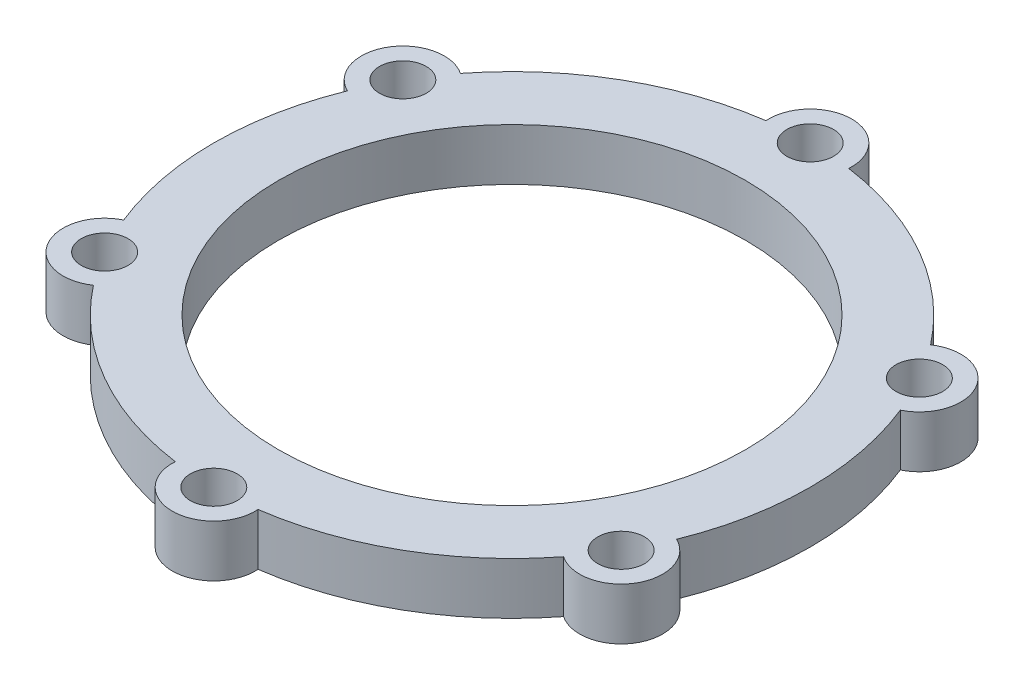
ISO-10303-21;
HEADER;
FILE_DESCRIPTION(('STEP AP214'),'2;1');
FILE_NAME('part.step','',(''),(''),'','','');
FILE_SCHEMA(('AUTOMOTIVE_DESIGN { 1 0 10303 214 1 1 1 1 }'));
ENDSEC;
DATA;
#1=APPLICATION_CONTEXT('core data for automotive mechanical design processes');
#2=APPLICATION_PROTOCOL_DEFINITION('international standard','automotive_design',2000,#1);
#3=PRODUCT_CONTEXT('',#1,'mechanical');
#4=PRODUCT('Part','Part','',(#3));
#5=PRODUCT_RELATED_PRODUCT_CATEGORY('part','',(#4));
#6=PRODUCT_DEFINITION_FORMATION('','',#4);
#7=PRODUCT_DEFINITION_CONTEXT('part definition',#1,'design');
#8=PRODUCT_DEFINITION('design','',#6,#7);
#9=PRODUCT_DEFINITION_SHAPE('','',#8);
#10=(LENGTH_UNIT() NAMED_UNIT(*) SI_UNIT(.MILLI.,.METRE.));
#11=(NAMED_UNIT(*) PLANE_ANGLE_UNIT() SI_UNIT($,.RADIAN.));
#12=(NAMED_UNIT(*) SI_UNIT($,.STERADIAN.) SOLID_ANGLE_UNIT());
#13=UNCERTAINTY_MEASURE_WITH_UNIT(LENGTH_MEASURE(1.E-05),#10,'distance_accuracy_value','');
#14=(GEOMETRIC_REPRESENTATION_CONTEXT(3) GLOBAL_UNCERTAINTY_ASSIGNED_CONTEXT((#13)) GLOBAL_UNIT_ASSIGNED_CONTEXT((#10,
#11,#12)) REPRESENTATION_CONTEXT('',''));
#15=CARTESIAN_POINT('',(0.,0.,0.));
#16=DIRECTION('',(0.,0.,1.));
#17=DIRECTION('',(1.,0.,0.));
#18=AXIS2_PLACEMENT_3D('',#15,#16,#17);
#19=CARTESIAN_POINT('',(0.,10.,-28.75));
#20=DIRECTION('',(0.,1.,0.));
#21=DIRECTION('',(0.,0.,1.));
#22=AXIS2_PLACEMENT_3D('',#19,#20,#21);
#23=PLANE('',#22);
#24=CARTESIAN_POINT('',(-49.7964607176055,10.,28.7499999999995));
#25=DIRECTION('',(0.,1.,0.));
#26=DIRECTION('',(0.,0.,1.));
#27=AXIS2_PLACEMENT_3D('',#24,#25,#26);
#28=CIRCLE('',#27,4.5);
#29=CARTESIAN_POINT('',(-49.7964607176055,10.,33.2499999999995));
#30=VERTEX_POINT('',#29);
#31=EDGE_CURVE('E348',#30,#30,#28,.T.);
#32=ORIENTED_EDGE('',*,*,#31,.F.);
#33=EDGE_LOOP('',(#32));
#34=FACE_BOUND('',#33,.T.);
#35=CARTESIAN_POINT('',(49.7964607176051,10.,28.7500000000002));
#36=DIRECTION('',(0.,1.,0.));
#37=DIRECTION('',(0.,0.,1.));
#38=AXIS2_PLACEMENT_3D('',#35,#36,#37);
#39=CIRCLE('',#38,4.5);
#40=CARTESIAN_POINT('',(49.7964607176051,10.,33.2500000000002));
#41=VERTEX_POINT('',#40);
#42=EDGE_CURVE('E364',#41,#41,#39,.T.);
#43=ORIENTED_EDGE('',*,*,#42,.F.);
#44=EDGE_LOOP('',(#43));
#45=FACE_BOUND('',#44,.T.);
#46=CARTESIAN_POINT('',(0.,10.,-57.5));
#47=DIRECTION('',(0.,1.,0.));
#48=DIRECTION('',(0.,0.,1.));
#49=AXIS2_PLACEMENT_3D('',#46,#47,#48);
#50=CIRCLE('',#49,4.5);
#51=CARTESIAN_POINT('',(0.,10.,-53.));
#52=VERTEX_POINT('',#51);
#53=EDGE_CURVE('E380',#52,#52,#50,.T.);
#54=ORIENTED_EDGE('',*,*,#53,.F.);
#55=EDGE_LOOP('',(#54));
#56=FACE_BOUND('',#55,.T.);
#57=CARTESIAN_POINT('',(0.,10.,-57.5));
#58=DIRECTION('',(0.,1.,0.));
#59=DIRECTION('',(0.,0.,1.));
#60=AXIS2_PLACEMENT_3D('',#57,#58,#59);
#61=CIRCLE('',#60,7.99999999999999);
#62=CARTESIAN_POINT('',(7.98061924626628,10.,-56.9434782608696));
#63=VERTEX_POINT('',#62);
#64=CARTESIAN_POINT('',(-7.98061924626619,10.,-56.9434782608696));
#65=VERTEX_POINT('',#64);
#66=EDGE_CURVE('E204',#63,#65,#61,.T.);
#67=ORIENTED_EDGE('',*,*,#66,.T.);
#68=CARTESIAN_POINT('',(0.,10.,0.));
#69=DIRECTION('',(0.,1.,0.));
#70=DIRECTION('',(0.,0.,1.));
#71=AXIS2_PLACEMENT_3D('',#68,#69,#70);
#72=CIRCLE('',#71,57.5);
#73=CARTESIAN_POINT('',(-45.3241891306268,10.,-35.3831581356324));
#74=VERTEX_POINT('',#73);
#75=EDGE_CURVE('E116',#65,#74,#72,.T.);
#76=ORIENTED_EDGE('',*,*,#75,.T.);
#77=CARTESIAN_POINT('',(-49.7964607176049,10.,-28.7500000000006));
#78=DIRECTION('',(0.,1.,0.));
#79=DIRECTION('',(0.,0.,1.));
#80=AXIS2_PLACEMENT_3D('',#77,#78,#79);
#81=CIRCLE('',#80,8.);
#82=CARTESIAN_POINT('',(-53.3048083768928,10.,-21.5603201252378));
#83=VERTEX_POINT('',#82);
#84=EDGE_CURVE('E241',#74,#83,#81,.T.);
#85=ORIENTED_EDGE('',*,*,#84,.T.);
#86=CARTESIAN_POINT('',(0.,10.,0.));
#87=DIRECTION('',(0.,1.,0.));
#88=DIRECTION('',(0.,0.,1.));
#89=AXIS2_PLACEMENT_3D('',#86,#87,#88);
#90=CIRCLE('',#89,57.5);
#91=CARTESIAN_POINT('',(-53.3048083768933,10.,21.5603201252367));
#92=VERTEX_POINT('',#91);
#93=EDGE_CURVE('E261',#83,#92,#90,.T.);
#94=ORIENTED_EDGE('',*,*,#93,.T.);
#95=CARTESIAN_POINT('',(-49.7964607176055,10.,28.7499999999995));
#96=DIRECTION('',(0.,1.,0.));
#97=DIRECTION('',(0.,0.,1.));
#98=AXIS2_PLACEMENT_3D('',#95,#96,#97);
#99=CIRCLE('',#98,8.00000000000025);
#100=CARTESIAN_POINT('',(-45.324189130627,10.,35.3831581356322));
#101=VERTEX_POINT('',#100);
#102=EDGE_CURVE('E257',#92,#101,#99,.T.);
#103=ORIENTED_EDGE('',*,*,#102,.T.);
#104=CARTESIAN_POINT('',(0.,10.,0.));
#105=DIRECTION('',(0.,1.,0.));
#106=DIRECTION('',(0.,0.,1.));
#107=AXIS2_PLACEMENT_3D('',#104,#105,#106);
#108=CIRCLE('',#107,57.5);
#109=CARTESIAN_POINT('',(-7.98061924626667,10.,56.9434782608695));
#110=VERTEX_POINT('',#109);
#111=EDGE_CURVE('E260',#101,#110,#108,.T.);
#112=ORIENTED_EDGE('',*,*,#111,.T.);
#113=CARTESIAN_POINT('',(-4.0152035396696E-13,10.,57.5));
#114=DIRECTION('',(0.,1.,0.));
#115=DIRECTION('',(0.,0.,1.));
#116=AXIS2_PLACEMENT_3D('',#113,#114,#115);
#117=CIRCLE('',#116,8.);
#118=CARTESIAN_POINT('',(7.98061924626585,10.,56.9434782608696));
#119=VERTEX_POINT('',#118);
#120=EDGE_CURVE('E265',#110,#119,#117,.T.);
#121=ORIENTED_EDGE('',*,*,#120,.T.);
#122=CARTESIAN_POINT('',(0.,10.,0.));
#123=DIRECTION('',(0.,1.,0.));
#124=DIRECTION('',(0.,0.,1.));
#125=AXIS2_PLACEMENT_3D('',#122,#123,#124);
#126=CIRCLE('',#125,57.5);
#127=CARTESIAN_POINT('',(45.3241891306267,10.,35.3831581356326));
#128=VERTEX_POINT('',#127);
#129=EDGE_CURVE('E272',#119,#128,#126,.T.);
#130=ORIENTED_EDGE('',*,*,#129,.T.);
#131=CARTESIAN_POINT('',(49.7964607176051,10.,28.7500000000002));
#132=DIRECTION('',(0.,1.,0.));
#133=DIRECTION('',(0.,0.,1.));
#134=AXIS2_PLACEMENT_3D('',#131,#132,#133);
#135=CIRCLE('',#134,8.00000000000012);
#136=CARTESIAN_POINT('',(53.304808376893,10.,21.5603201252373));
#137=VERTEX_POINT('',#136);
#138=EDGE_CURVE('E147',#128,#137,#135,.T.);
#139=ORIENTED_EDGE('',*,*,#138,.T.);
#140=CARTESIAN_POINT('',(0.,10.,0.));
#141=DIRECTION('',(0.,1.,0.));
#142=DIRECTION('',(0.,0.,1.));
#143=AXIS2_PLACEMENT_3D('',#140,#141,#142);
#144=CIRCLE('',#143,57.5);
#145=CARTESIAN_POINT('',(53.3048083768931,10.,-21.5603201252372));
#146=VERTEX_POINT('',#145);
#147=EDGE_CURVE('E141',#137,#146,#144,.T.);
#148=ORIENTED_EDGE('',*,*,#147,.T.);
#149=CARTESIAN_POINT('',(49.7964607176053,10.,-28.7499999999999));
#150=DIRECTION('',(0.,1.,0.));
#151=DIRECTION('',(0.,0.,1.));
#152=AXIS2_PLACEMENT_3D('',#149,#150,#151);
#153=CIRCLE('',#152,7.99999999999994);
#154=CARTESIAN_POINT('',(45.324189130627,10.,-35.3831581356322));
#155=VERTEX_POINT('',#154);
#156=EDGE_CURVE('E145',#146,#155,#153,.T.);
#157=ORIENTED_EDGE('',*,*,#156,.T.);
#158=CARTESIAN_POINT('',(0.,10.,0.));
#159=DIRECTION('',(0.,1.,0.));
#160=DIRECTION('',(0.,0.,1.));
#161=AXIS2_PLACEMENT_3D('',#158,#159,#160);
#162=CIRCLE('',#161,57.5);
#163=EDGE_CURVE('E61',#155,#63,#162,.T.);
#164=ORIENTED_EDGE('',*,*,#163,.T.);
#165=EDGE_LOOP('',(#67,#76,#85,#94,#103,#112,#121,#130,#139,#148,#157,#164));
#166=FACE_BOUND('',#165,.T.);
#167=CARTESIAN_POINT('',(0.,10.,0.));
#168=DIRECTION('',(0.,1.,0.));
#169=DIRECTION('',(0.,0.,1.));
#170=AXIS2_PLACEMENT_3D('',#167,#168,#169);
#171=CIRCLE('',#170,45.);
#172=CARTESIAN_POINT('',(0.,10.,45.));
#173=VERTEX_POINT('',#172);
#174=EDGE_CURVE('E174',#173,#173,#171,.T.);
#175=ORIENTED_EDGE('',*,*,#174,.F.);
#176=EDGE_LOOP('',(#175));
#177=FACE_BOUND('',#176,.T.);
#178=CARTESIAN_POINT('',(49.7964607176053,10.,-28.7499999999999));
#179=DIRECTION('',(0.,1.,0.));
#180=DIRECTION('',(0.,0.,1.));
#181=AXIS2_PLACEMENT_3D('',#178,#179,#180);
#182=CIRCLE('',#181,4.5);
#183=CARTESIAN_POINT('',(49.7964607176053,10.,-24.2499999999999));
#184=VERTEX_POINT('',#183);
#185=EDGE_CURVE('E372',#184,#184,#182,.T.);
#186=ORIENTED_EDGE('',*,*,#185,.F.);
#187=EDGE_LOOP('',(#186));
#188=FACE_BOUND('',#187,.T.);
#189=CARTESIAN_POINT('',(-4.0152035396696E-13,10.,57.5));
#190=DIRECTION('',(0.,1.,0.));
#191=DIRECTION('',(0.,0.,1.));
#192=AXIS2_PLACEMENT_3D('',#189,#190,#191);
#193=CIRCLE('',#192,4.5);
#194=CARTESIAN_POINT('',(-4.0152035396696E-13,10.,62.));
#195=VERTEX_POINT('',#194);
#196=EDGE_CURVE('E356',#195,#195,#193,.T.);
#197=ORIENTED_EDGE('',*,*,#196,.F.);
#198=EDGE_LOOP('',(#197));
#199=FACE_BOUND('',#198,.T.);
#200=CARTESIAN_POINT('',(-49.7964607176049,10.,-28.7500000000006));
#201=DIRECTION('',(0.,1.,0.));
#202=DIRECTION('',(0.,0.,1.));
#203=AXIS2_PLACEMENT_3D('',#200,#201,#202);
#204=CIRCLE('',#203,4.5);
#205=CARTESIAN_POINT('',(-49.7964607176049,10.,-24.2500000000006));
#206=VERTEX_POINT('',#205);
#207=EDGE_CURVE('E337',#206,#206,#204,.T.);
#208=ORIENTED_EDGE('',*,*,#207,.F.);
#209=EDGE_LOOP('',(#208));
#210=FACE_BOUND('',#209,.T.);
#211=ADVANCED_FACE('F43',(#34,#45,#56,#166,#177,#188,#199,#210),#23,.T.);
#212=CARTESIAN_POINT('',(0.,0.,-28.75));
#213=DIRECTION('',(0.,1.,0.));
#214=DIRECTION('',(0.,0.,1.));
#215=AXIS2_PLACEMENT_3D('',#212,#213,#214);
#216=PLANE('',#215);
#217=CARTESIAN_POINT('',(0.,0.,-57.5));
#218=DIRECTION('',(0.,1.,0.));
#219=DIRECTION('',(0.,0.,1.));
#220=AXIS2_PLACEMENT_3D('',#217,#218,#219);
#221=CIRCLE('',#220,7.99999999999999);
#222=CARTESIAN_POINT('',(7.98061924626628,0.,-56.9434782608696));
#223=VERTEX_POINT('',#222);
#224=CARTESIAN_POINT('',(-7.98061924626619,0.,-56.9434782608696));
#225=VERTEX_POINT('',#224);
#226=EDGE_CURVE('E169',#223,#225,#221,.T.);
#227=ORIENTED_EDGE('',*,*,#226,.F.);
#228=CARTESIAN_POINT('',(0.,0.,0.));
#229=DIRECTION('',(0.,1.,0.));
#230=DIRECTION('',(0.,0.,1.));
#231=AXIS2_PLACEMENT_3D('',#228,#229,#230);
#232=CIRCLE('',#231,57.5);
#233=CARTESIAN_POINT('',(45.324189130627,0.,-35.3831581356322));
#234=VERTEX_POINT('',#233);
#235=EDGE_CURVE('E108',#234,#223,#232,.T.);
#236=ORIENTED_EDGE('',*,*,#235,.F.);
#237=CARTESIAN_POINT('',(49.7964607176053,0.,-28.7499999999999));
#238=DIRECTION('',(0.,1.,0.));
#239=DIRECTION('',(0.,0.,1.));
#240=AXIS2_PLACEMENT_3D('',#237,#238,#239);
#241=CIRCLE('',#240,7.99999999999994);
#242=CARTESIAN_POINT('',(53.3048083768931,0.,-21.5603201252372));
#243=VERTEX_POINT('',#242);
#244=EDGE_CURVE('E102',#243,#234,#241,.T.);
#245=ORIENTED_EDGE('',*,*,#244,.F.);
#246=CARTESIAN_POINT('',(0.,0.,0.));
#247=DIRECTION('',(0.,1.,0.));
#248=DIRECTION('',(0.,0.,1.));
#249=AXIS2_PLACEMENT_3D('',#246,#247,#248);
#250=CIRCLE('',#249,57.5);
#251=CARTESIAN_POINT('',(53.304808376893,0.,21.5603201252373));
#252=VERTEX_POINT('',#251);
#253=EDGE_CURVE('E156',#252,#243,#250,.T.);
#254=ORIENTED_EDGE('',*,*,#253,.F.);
#255=CARTESIAN_POINT('',(49.7964607176051,0.,28.7500000000002));
#256=DIRECTION('',(0.,1.,0.));
#257=DIRECTION('',(0.,0.,1.));
#258=AXIS2_PLACEMENT_3D('',#255,#256,#257);
#259=CIRCLE('',#258,8.00000000000012);
#260=CARTESIAN_POINT('',(45.3241891306267,0.,35.3831581356326));
#261=VERTEX_POINT('',#260);
#262=EDGE_CURVE('E195',#261,#252,#259,.T.);
#263=ORIENTED_EDGE('',*,*,#262,.F.);
#264=CARTESIAN_POINT('',(0.,0.,0.));
#265=DIRECTION('',(0.,1.,0.));
#266=DIRECTION('',(0.,0.,1.));
#267=AXIS2_PLACEMENT_3D('',#264,#265,#266);
#268=CIRCLE('',#267,57.5);
#269=CARTESIAN_POINT('',(7.98061924626585,0.,56.9434782608696));
#270=VERTEX_POINT('',#269);
#271=EDGE_CURVE('E192',#270,#261,#268,.T.);
#272=ORIENTED_EDGE('',*,*,#271,.F.);
#273=CARTESIAN_POINT('',(-4.0152035396696E-13,0.,57.5));
#274=DIRECTION('',(0.,1.,0.));
#275=DIRECTION('',(0.,0.,1.));
#276=AXIS2_PLACEMENT_3D('',#273,#274,#275);
#277=CIRCLE('',#276,8.);
#278=CARTESIAN_POINT('',(-7.98061924626667,0.,56.9434782608695));
#279=VERTEX_POINT('',#278);
#280=EDGE_CURVE('E189',#279,#270,#277,.T.);
#281=ORIENTED_EDGE('',*,*,#280,.F.);
#282=CARTESIAN_POINT('',(0.,0.,0.));
#283=DIRECTION('',(0.,1.,0.));
#284=DIRECTION('',(0.,0.,1.));
#285=AXIS2_PLACEMENT_3D('',#282,#283,#284);
#286=CIRCLE('',#285,57.5);
#287=CARTESIAN_POINT('',(-45.324189130627,0.,35.3831581356322));
#288=VERTEX_POINT('',#287);
#289=EDGE_CURVE('E186',#288,#279,#286,.T.);
#290=ORIENTED_EDGE('',*,*,#289,.F.);
#291=CARTESIAN_POINT('',(-49.7964607176055,0.,28.7499999999995));
#292=DIRECTION('',(0.,1.,0.));
#293=DIRECTION('',(0.,0.,1.));
#294=AXIS2_PLACEMENT_3D('',#291,#292,#293);
#295=CIRCLE('',#294,8.00000000000025);
#296=CARTESIAN_POINT('',(-53.3048083768933,0.,21.5603201252367));
#297=VERTEX_POINT('',#296);
#298=EDGE_CURVE('E183',#297,#288,#295,.T.);
#299=ORIENTED_EDGE('',*,*,#298,.F.);
#300=CARTESIAN_POINT('',(0.,0.,0.));
#301=DIRECTION('',(0.,1.,0.));
#302=DIRECTION('',(0.,0.,1.));
#303=AXIS2_PLACEMENT_3D('',#300,#301,#302);
#304=CIRCLE('',#303,57.5);
#305=CARTESIAN_POINT('',(-53.3048083768928,0.,-21.5603201252378));
#306=VERTEX_POINT('',#305);
#307=EDGE_CURVE('E180',#306,#297,#304,.T.);
#308=ORIENTED_EDGE('',*,*,#307,.F.);
#309=CARTESIAN_POINT('',(-49.7964607176049,0.,-28.7500000000006));
#310=DIRECTION('',(0.,1.,0.));
#311=DIRECTION('',(0.,0.,1.));
#312=AXIS2_PLACEMENT_3D('',#309,#310,#311);
#313=CIRCLE('',#312,8.);
#314=CARTESIAN_POINT('',(-45.3241891306268,0.,-35.3831581356324));
#315=VERTEX_POINT('',#314);
#316=EDGE_CURVE('E177',#315,#306,#313,.T.);
#317=ORIENTED_EDGE('',*,*,#316,.F.);
#318=CARTESIAN_POINT('',(0.,0.,0.));
#319=DIRECTION('',(0.,1.,0.));
#320=DIRECTION('',(0.,0.,1.));
#321=AXIS2_PLACEMENT_3D('',#318,#319,#320);
#322=CIRCLE('',#321,57.5);
#323=EDGE_CURVE('E173',#225,#315,#322,.T.);
#324=ORIENTED_EDGE('',*,*,#323,.F.);
#325=EDGE_LOOP('',(#227,#236,#245,#254,#263,#272,#281,#290,#299,#308,#317,#324));
#326=FACE_BOUND('',#325,.T.);
#327=CARTESIAN_POINT('',(0.,0.,0.));
#328=DIRECTION('',(0.,1.,0.));
#329=DIRECTION('',(0.,0.,1.));
#330=AXIS2_PLACEMENT_3D('',#327,#328,#329);
#331=CIRCLE('',#330,45.);
#332=CARTESIAN_POINT('',(0.,0.,45.));
#333=VERTEX_POINT('',#332);
#334=EDGE_CURVE('E384',#333,#333,#331,.T.);
#335=ORIENTED_EDGE('',*,*,#334,.T.);
#336=EDGE_LOOP('',(#335));
#337=FACE_BOUND('',#336,.T.);
#338=CARTESIAN_POINT('',(0.,0.,-57.5));
#339=DIRECTION('',(0.,1.,0.));
#340=DIRECTION('',(0.,0.,1.));
#341=AXIS2_PLACEMENT_3D('',#338,#339,#340);
#342=CIRCLE('',#341,4.5);
#343=CARTESIAN_POINT('',(0.,0.,-53.));
#344=VERTEX_POINT('',#343);
#345=EDGE_CURVE('E376',#344,#344,#342,.T.);
#346=ORIENTED_EDGE('',*,*,#345,.T.);
#347=EDGE_LOOP('',(#346));
#348=FACE_BOUND('',#347,.T.);
#349=CARTESIAN_POINT('',(49.7964607176053,0.,-28.7499999999999));
#350=DIRECTION('',(0.,1.,0.));
#351=DIRECTION('',(0.,0.,1.));
#352=AXIS2_PLACEMENT_3D('',#349,#350,#351);
#353=CIRCLE('',#352,4.5);
#354=CARTESIAN_POINT('',(49.7964607176053,0.,-24.2499999999999));
#355=VERTEX_POINT('',#354);
#356=EDGE_CURVE('E368',#355,#355,#353,.T.);
#357=ORIENTED_EDGE('',*,*,#356,.T.);
#358=EDGE_LOOP('',(#357));
#359=FACE_BOUND('',#358,.T.);
#360=CARTESIAN_POINT('',(49.7964607176051,0.,28.7500000000002));
#361=DIRECTION('',(0.,1.,0.));
#362=DIRECTION('',(0.,0.,1.));
#363=AXIS2_PLACEMENT_3D('',#360,#361,#362);
#364=CIRCLE('',#363,4.5);
#365=CARTESIAN_POINT('',(49.7964607176051,0.,33.2500000000002));
#366=VERTEX_POINT('',#365);
#367=EDGE_CURVE('E360',#366,#366,#364,.T.);
#368=ORIENTED_EDGE('',*,*,#367,.T.);
#369=EDGE_LOOP('',(#368));
#370=FACE_BOUND('',#369,.T.);
#371=CARTESIAN_POINT('',(-4.0152035396696E-13,0.,57.5));
#372=DIRECTION('',(0.,1.,0.));
#373=DIRECTION('',(0.,0.,1.));
#374=AXIS2_PLACEMENT_3D('',#371,#372,#373);
#375=CIRCLE('',#374,4.5);
#376=CARTESIAN_POINT('',(-4.0152035396696E-13,0.,62.));
#377=VERTEX_POINT('',#376);
#378=EDGE_CURVE('E352',#377,#377,#375,.T.);
#379=ORIENTED_EDGE('',*,*,#378,.T.);
#380=EDGE_LOOP('',(#379));
#381=FACE_BOUND('',#380,.T.);
#382=CARTESIAN_POINT('',(-49.7964607176055,0.,28.7499999999995));
#383=DIRECTION('',(0.,1.,0.));
#384=DIRECTION('',(0.,0.,1.));
#385=AXIS2_PLACEMENT_3D('',#382,#383,#384);
#386=CIRCLE('',#385,4.5);
#387=CARTESIAN_POINT('',(-49.7964607176055,0.,33.2499999999995));
#388=VERTEX_POINT('',#387);
#389=EDGE_CURVE('E345',#388,#388,#386,.T.);
#390=ORIENTED_EDGE('',*,*,#389,.T.);
#391=EDGE_LOOP('',(#390));
#392=FACE_BOUND('',#391,.T.);
#393=CARTESIAN_POINT('',(-49.7964607176049,0.,-28.7500000000006));
#394=DIRECTION('',(0.,1.,0.));
#395=DIRECTION('',(0.,0.,1.));
#396=AXIS2_PLACEMENT_3D('',#393,#394,#395);
#397=CIRCLE('',#396,4.5);
#398=CARTESIAN_POINT('',(-49.7964607176049,0.,-24.2500000000006));
#399=VERTEX_POINT('',#398);
#400=EDGE_CURVE('E340',#399,#399,#397,.T.);
#401=ORIENTED_EDGE('',*,*,#400,.T.);
#402=EDGE_LOOP('',(#401));
#403=FACE_BOUND('',#402,.T.);
#404=ADVANCED_FACE('F245',(#326,#337,#348,#359,#370,#381,#392,#403),#216,.F.);
#405=CARTESIAN_POINT('',(0.,10.,-57.5));
#406=DIRECTION('',(0.,-1.,0.));
#407=DIRECTION('',(0.,0.,-1.));
#408=AXIS2_PLACEMENT_3D('',#405,#406,#407);
#409=CYLINDRICAL_SURFACE('',#408,7.99999999999999);
#410=ORIENTED_EDGE('',*,*,#226,.T.);
#411=DIRECTION('',(0.,-1.,0.));
#412=VECTOR('',#411,1.);
#413=CARTESIAN_POINT('',(-7.98061924626619,10.,-56.9434782608696));
#414=LINE('',#413,#412);
#415=EDGE_CURVE('E11',#65,#225,#414,.T.);
#416=ORIENTED_EDGE('',*,*,#415,.F.);
#417=ORIENTED_EDGE('',*,*,#66,.F.);
#418=DIRECTION('',(0.,-1.,0.));
#419=VECTOR('',#418,1.);
#420=CARTESIAN_POINT('',(7.98061924626628,10.,-56.9434782608696));
#421=LINE('',#420,#419);
#422=EDGE_CURVE('E165',#63,#223,#421,.T.);
#423=ORIENTED_EDGE('',*,*,#422,.T.);
#424=EDGE_LOOP('',(#410,#416,#417,#423));
#425=FACE_BOUND('',#424,.T.);
#426=ADVANCED_FACE('F45',(#425),#409,.T.);
#427=CARTESIAN_POINT('',(0.,10.,0.));
#428=DIRECTION('',(0.,-1.,0.));
#429=DIRECTION('',(0.,0.,-1.));
#430=AXIS2_PLACEMENT_3D('',#427,#428,#429);
#431=CYLINDRICAL_SURFACE('',#430,57.5);
#432=ORIENTED_EDGE('',*,*,#323,.T.);
#433=DIRECTION('',(0.,-1.,0.));
#434=VECTOR('',#433,1.);
#435=CARTESIAN_POINT('',(-45.3241891306268,10.,-35.3831581356324));
#436=LINE('',#435,#434);
#437=EDGE_CURVE('E53',#74,#315,#436,.T.);
#438=ORIENTED_EDGE('',*,*,#437,.F.);
#439=ORIENTED_EDGE('',*,*,#75,.F.);
#440=ORIENTED_EDGE('',*,*,#415,.T.);
#441=EDGE_LOOP('',(#432,#438,#439,#440));
#442=FACE_BOUND('',#441,.T.);
#443=ADVANCED_FACE('F537',(#442),#431,.T.);
#444=CARTESIAN_POINT('',(-49.7964607176049,10.,-28.7500000000006));
#445=DIRECTION('',(0.,-1.,0.));
#446=DIRECTION('',(0.,0.,-1.));
#447=AXIS2_PLACEMENT_3D('',#444,#445,#446);
#448=CYLINDRICAL_SURFACE('',#447,8.);
#449=ORIENTED_EDGE('',*,*,#316,.T.);
#450=DIRECTION('',(0.,-1.,0.));
#451=VECTOR('',#450,1.);
#452=CARTESIAN_POINT('',(-53.3048083768928,10.,-21.5603201252378));
#453=LINE('',#452,#451);
#454=EDGE_CURVE('E231',#83,#306,#453,.T.);
#455=ORIENTED_EDGE('',*,*,#454,.F.);
#456=ORIENTED_EDGE('',*,*,#84,.F.);
#457=ORIENTED_EDGE('',*,*,#437,.T.);
#458=EDGE_LOOP('',(#449,#455,#456,#457));
#459=FACE_BOUND('',#458,.T.);
#460=ADVANCED_FACE('F239',(#459),#448,.T.);
#461=CARTESIAN_POINT('',(0.,10.,0.));
#462=DIRECTION('',(0.,-1.,0.));
#463=DIRECTION('',(0.,0.,-1.));
#464=AXIS2_PLACEMENT_3D('',#461,#462,#463);
#465=CYLINDRICAL_SURFACE('',#464,57.5);
#466=ORIENTED_EDGE('',*,*,#307,.T.);
#467=DIRECTION('',(0.,-1.,0.));
#468=VECTOR('',#467,1.);
#469=CARTESIAN_POINT('',(-53.3048083768933,10.,21.5603201252367));
#470=LINE('',#469,#468);
#471=EDGE_CURVE('E227',#92,#297,#470,.T.);
#472=ORIENTED_EDGE('',*,*,#471,.F.);
#473=ORIENTED_EDGE('',*,*,#93,.F.);
#474=ORIENTED_EDGE('',*,*,#454,.T.);
#475=EDGE_LOOP('',(#466,#472,#473,#474));
#476=FACE_BOUND('',#475,.T.);
#477=ADVANCED_FACE('F251',(#476),#465,.T.);
#478=CARTESIAN_POINT('',(-49.7964607176055,10.,28.7499999999995));
#479=DIRECTION('',(0.,-1.,0.));
#480=DIRECTION('',(0.,0.,-1.));
#481=AXIS2_PLACEMENT_3D('',#478,#479,#480);
#482=CYLINDRICAL_SURFACE('',#481,8.00000000000025);
#483=ORIENTED_EDGE('',*,*,#298,.T.);
#484=DIRECTION('',(0.,-1.,0.));
#485=VECTOR('',#484,1.);
#486=CARTESIAN_POINT('',(-45.324189130627,10.,35.3831581356322));
#487=LINE('',#486,#485);
#488=EDGE_CURVE('E223',#101,#288,#487,.T.);
#489=ORIENTED_EDGE('',*,*,#488,.F.);
#490=ORIENTED_EDGE('',*,*,#102,.F.);
#491=ORIENTED_EDGE('',*,*,#471,.T.);
#492=EDGE_LOOP('',(#483,#489,#490,#491));
#493=FACE_BOUND('',#492,.T.);
#494=ADVANCED_FACE('F255',(#493),#482,.T.);
#495=CARTESIAN_POINT('',(0.,10.,0.));
#496=DIRECTION('',(0.,-1.,0.));
#497=DIRECTION('',(0.,0.,-1.));
#498=AXIS2_PLACEMENT_3D('',#495,#496,#497);
#499=CYLINDRICAL_SURFACE('',#498,57.5);
#500=ORIENTED_EDGE('',*,*,#289,.T.);
#501=DIRECTION('',(0.,-1.,0.));
#502=VECTOR('',#501,1.);
#503=CARTESIAN_POINT('',(-7.98061924626667,10.,56.9434782608695));
#504=LINE('',#503,#502);
#505=EDGE_CURVE('E219',#110,#279,#504,.T.);
#506=ORIENTED_EDGE('',*,*,#505,.F.);
#507=ORIENTED_EDGE('',*,*,#111,.F.);
#508=ORIENTED_EDGE('',*,*,#488,.T.);
#509=EDGE_LOOP('',(#500,#506,#507,#508));
#510=FACE_BOUND('',#509,.T.);
#511=ADVANCED_FACE('F498',(#510),#499,.T.);
#512=CARTESIAN_POINT('',(-4.0152035396696E-13,10.,57.5));
#513=DIRECTION('',(0.,-1.,0.));
#514=DIRECTION('',(0.,0.,-1.));
#515=AXIS2_PLACEMENT_3D('',#512,#513,#514);
#516=CYLINDRICAL_SURFACE('',#515,8.);
#517=ORIENTED_EDGE('',*,*,#280,.T.);
#518=DIRECTION('',(0.,-1.,0.));
#519=VECTOR('',#518,1.);
#520=CARTESIAN_POINT('',(7.98061924626585,10.,56.9434782608696));
#521=LINE('',#520,#519);
#522=EDGE_CURVE('E215',#119,#270,#521,.T.);
#523=ORIENTED_EDGE('',*,*,#522,.F.);
#524=ORIENTED_EDGE('',*,*,#120,.F.);
#525=ORIENTED_EDGE('',*,*,#505,.T.);
#526=EDGE_LOOP('',(#517,#523,#524,#525));
#527=FACE_BOUND('',#526,.T.);
#528=ADVANCED_FACE('F488',(#527),#516,.T.);
#529=CARTESIAN_POINT('',(0.,10.,0.));
#530=DIRECTION('',(0.,-1.,0.));
#531=DIRECTION('',(0.,0.,-1.));
#532=AXIS2_PLACEMENT_3D('',#529,#530,#531);
#533=CYLINDRICAL_SURFACE('',#532,57.5);
#534=ORIENTED_EDGE('',*,*,#271,.T.);
#535=DIRECTION('',(0.,-1.,0.));
#536=VECTOR('',#535,1.);
#537=CARTESIAN_POINT('',(45.3241891306267,10.,35.3831581356326));
#538=LINE('',#537,#536);
#539=EDGE_CURVE('E211',#128,#261,#538,.T.);
#540=ORIENTED_EDGE('',*,*,#539,.F.);
#541=ORIENTED_EDGE('',*,*,#129,.F.);
#542=ORIENTED_EDGE('',*,*,#522,.T.);
#543=EDGE_LOOP('',(#534,#540,#541,#542));
#544=FACE_BOUND('',#543,.T.);
#545=ADVANCED_FACE('F280',(#544),#533,.T.);
#546=CARTESIAN_POINT('',(49.7964607176051,10.,28.7500000000002));
#547=DIRECTION('',(0.,-1.,0.));
#548=DIRECTION('',(0.,0.,-1.));
#549=AXIS2_PLACEMENT_3D('',#546,#547,#548);
#550=CYLINDRICAL_SURFACE('',#549,8.00000000000012);
#551=ORIENTED_EDGE('',*,*,#262,.T.);
#552=DIRECTION('',(0.,-1.,0.));
#553=VECTOR('',#552,1.);
#554=CARTESIAN_POINT('',(53.304808376893,10.,21.5603201252373));
#555=LINE('',#554,#553);
#556=EDGE_CURVE('E158',#137,#252,#555,.T.);
#557=ORIENTED_EDGE('',*,*,#556,.F.);
#558=ORIENTED_EDGE('',*,*,#138,.F.);
#559=ORIENTED_EDGE('',*,*,#539,.T.);
#560=EDGE_LOOP('',(#551,#557,#558,#559));
#561=FACE_BOUND('',#560,.T.);
#562=ADVANCED_FACE('F284',(#561),#550,.T.);
#563=CARTESIAN_POINT('',(0.,10.,0.));
#564=DIRECTION('',(0.,-1.,0.));
#565=DIRECTION('',(0.,0.,-1.));
#566=AXIS2_PLACEMENT_3D('',#563,#564,#565);
#567=CYLINDRICAL_SURFACE('',#566,57.5);
#568=ORIENTED_EDGE('',*,*,#253,.T.);
#569=DIRECTION('',(0.,-1.,0.));
#570=VECTOR('',#569,1.);
#571=CARTESIAN_POINT('',(53.3048083768931,10.,-21.5603201252372));
#572=LINE('',#571,#570);
#573=EDGE_CURVE('E153',#146,#243,#572,.T.);
#574=ORIENTED_EDGE('',*,*,#573,.F.);
#575=ORIENTED_EDGE('',*,*,#147,.F.);
#576=ORIENTED_EDGE('',*,*,#556,.T.);
#577=EDGE_LOOP('',(#568,#574,#575,#576));
#578=FACE_BOUND('',#577,.T.);
#579=ADVANCED_FACE('F154',(#578),#567,.T.);
#580=CARTESIAN_POINT('',(49.7964607176053,10.,-28.7499999999999));
#581=DIRECTION('',(0.,-1.,0.));
#582=DIRECTION('',(0.,0.,-1.));
#583=AXIS2_PLACEMENT_3D('',#580,#581,#582);
#584=CYLINDRICAL_SURFACE('',#583,7.99999999999994);
#585=ORIENTED_EDGE('',*,*,#244,.T.);
#586=DIRECTION('',(0.,-1.,0.));
#587=VECTOR('',#586,1.);
#588=CARTESIAN_POINT('',(45.324189130627,10.,-35.3831581356322));
#589=LINE('',#588,#587);
#590=EDGE_CURVE('E159',#155,#234,#589,.T.);
#591=ORIENTED_EDGE('',*,*,#590,.F.);
#592=ORIENTED_EDGE('',*,*,#156,.F.);
#593=ORIENTED_EDGE('',*,*,#573,.T.);
#594=EDGE_LOOP('',(#585,#591,#592,#593));
#595=FACE_BOUND('',#594,.T.);
#596=ADVANCED_FACE('F161',(#595),#584,.T.);
#597=CARTESIAN_POINT('',(0.,10.,0.));
#598=DIRECTION('',(0.,-1.,0.));
#599=DIRECTION('',(0.,0.,-1.));
#600=AXIS2_PLACEMENT_3D('',#597,#598,#599);
#601=CYLINDRICAL_SURFACE('',#600,57.5);
#602=ORIENTED_EDGE('',*,*,#235,.T.);
#603=ORIENTED_EDGE('',*,*,#422,.F.);
#604=ORIENTED_EDGE('',*,*,#163,.F.);
#605=ORIENTED_EDGE('',*,*,#590,.T.);
#606=EDGE_LOOP('',(#602,#603,#604,#605));
#607=FACE_BOUND('',#606,.T.);
#608=ADVANCED_FACE('F288',(#607),#601,.T.);
#609=CARTESIAN_POINT('',(0.,10.,0.));
#610=DIRECTION('',(0.,-1.,0.));
#611=DIRECTION('',(0.,0.,-1.));
#612=AXIS2_PLACEMENT_3D('',#609,#610,#611);
#613=CYLINDRICAL_SURFACE('',#612,45.);
#614=ORIENTED_EDGE('',*,*,#174,.T.);
#615=EDGE_LOOP('',(#614));
#616=FACE_BOUND('',#615,.T.);
#617=ORIENTED_EDGE('',*,*,#334,.F.);
#618=EDGE_LOOP('',(#617));
#619=FACE_BOUND('',#618,.T.);
#620=ADVANCED_FACE('F290',(#616,#619),#613,.F.);
#621=CARTESIAN_POINT('',(0.,10.,-57.5));
#622=DIRECTION('',(0.,-1.,0.));
#623=DIRECTION('',(0.,0.,-1.));
#624=AXIS2_PLACEMENT_3D('',#621,#622,#623);
#625=CYLINDRICAL_SURFACE('',#624,4.5);
#626=ORIENTED_EDGE('',*,*,#53,.T.);
#627=EDGE_LOOP('',(#626));
#628=FACE_BOUND('',#627,.T.);
#629=ORIENTED_EDGE('',*,*,#345,.F.);
#630=EDGE_LOOP('',(#629));
#631=FACE_BOUND('',#630,.T.);
#632=ADVANCED_FACE('F296',(#628,#631),#625,.F.);
#633=CARTESIAN_POINT('',(49.7964607176053,10.,-28.7499999999999));
#634=DIRECTION('',(0.,-1.,0.));
#635=DIRECTION('',(0.,0.,-1.));
#636=AXIS2_PLACEMENT_3D('',#633,#634,#635);
#637=CYLINDRICAL_SURFACE('',#636,4.5);
#638=ORIENTED_EDGE('',*,*,#185,.T.);
#639=EDGE_LOOP('',(#638));
#640=FACE_BOUND('',#639,.T.);
#641=ORIENTED_EDGE('',*,*,#356,.F.);
#642=EDGE_LOOP('',(#641));
#643=FACE_BOUND('',#642,.T.);
#644=ADVANCED_FACE('F312',(#640,#643),#637,.F.);
#645=CARTESIAN_POINT('',(49.7964607176051,10.,28.7500000000002));
#646=DIRECTION('',(0.,-1.,0.));
#647=DIRECTION('',(0.,0.,-1.));
#648=AXIS2_PLACEMENT_3D('',#645,#646,#647);
#649=CYLINDRICAL_SURFACE('',#648,4.5);
#650=ORIENTED_EDGE('',*,*,#42,.T.);
#651=EDGE_LOOP('',(#650));
#652=FACE_BOUND('',#651,.T.);
#653=ORIENTED_EDGE('',*,*,#367,.F.);
#654=EDGE_LOOP('',(#653));
#655=FACE_BOUND('',#654,.T.);
#656=ADVANCED_FACE('F316',(#652,#655),#649,.F.);
#657=CARTESIAN_POINT('',(-4.0152035396696E-13,10.,57.5));
#658=DIRECTION('',(0.,-1.,0.));
#659=DIRECTION('',(0.,0.,-1.));
#660=AXIS2_PLACEMENT_3D('',#657,#658,#659);
#661=CYLINDRICAL_SURFACE('',#660,4.5);
#662=ORIENTED_EDGE('',*,*,#196,.T.);
#663=EDGE_LOOP('',(#662));
#664=FACE_BOUND('',#663,.T.);
#665=ORIENTED_EDGE('',*,*,#378,.F.);
#666=EDGE_LOOP('',(#665));
#667=FACE_BOUND('',#666,.T.);
#668=ADVANCED_FACE('F320',(#664,#667),#661,.F.);
#669=CARTESIAN_POINT('',(-49.7964607176055,10.,28.7499999999995));
#670=DIRECTION('',(0.,-1.,0.));
#671=DIRECTION('',(0.,0.,-1.));
#672=AXIS2_PLACEMENT_3D('',#669,#670,#671);
#673=CYLINDRICAL_SURFACE('',#672,4.5);
#674=ORIENTED_EDGE('',*,*,#31,.T.);
#675=EDGE_LOOP('',(#674));
#676=FACE_BOUND('',#675,.T.);
#677=ORIENTED_EDGE('',*,*,#389,.F.);
#678=EDGE_LOOP('',(#677));
#679=FACE_BOUND('',#678,.T.);
#680=ADVANCED_FACE('F324',(#676,#679),#673,.F.);
#681=CARTESIAN_POINT('',(-49.7964607176049,10.,-28.7500000000006));
#682=DIRECTION('',(0.,-1.,0.));
#683=DIRECTION('',(0.,0.,-1.));
#684=AXIS2_PLACEMENT_3D('',#681,#682,#683);
#685=CYLINDRICAL_SURFACE('',#684,4.5);
#686=ORIENTED_EDGE('',*,*,#207,.T.);
#687=EDGE_LOOP('',(#686));
#688=FACE_BOUND('',#687,.T.);
#689=ORIENTED_EDGE('',*,*,#400,.F.);
#690=EDGE_LOOP('',(#689));
#691=FACE_BOUND('',#690,.T.);
#692=ADVANCED_FACE('F328',(#688,#691),#685,.F.);
#693=CLOSED_SHELL('',(#211,#404,#426,#443,#460,#477,#494,#511,#528,#545,#562,#579,#596,#608,
#620,#632,#644,#656,#668,#680,#692));
#694=MANIFOLD_SOLID_BREP('B2',#693);
#695=ADVANCED_BREP_SHAPE_REPRESENTATION('',(#18,#694),#14);
#696=SHAPE_DEFINITION_REPRESENTATION(#9,#695);
ENDSEC;
END-ISO-10303-21;
